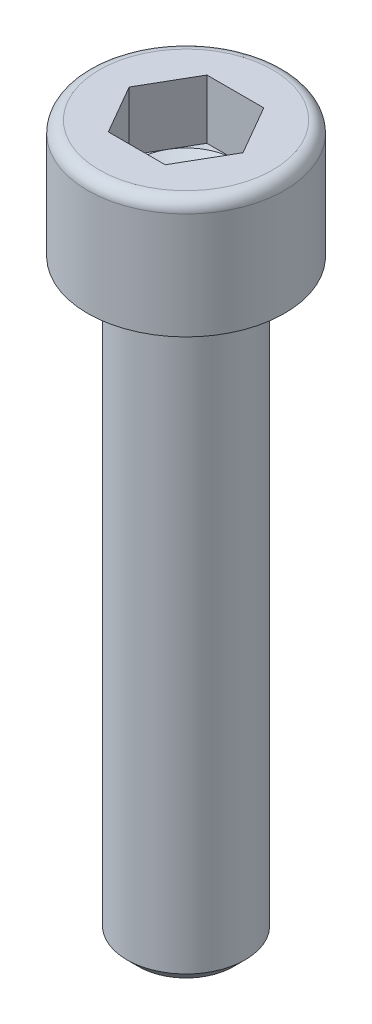
ISO-10303-21;
HEADER;
FILE_DESCRIPTION(('STEP AP214'),'2;1');
FILE_NAME('part.step','',(''),(''),'','','');
FILE_SCHEMA(('AUTOMOTIVE_DESIGN { 1 0 10303 214 1 1 1 1 }'));
ENDSEC;
DATA;
#1=APPLICATION_CONTEXT('core data for automotive mechanical design processes');
#2=APPLICATION_PROTOCOL_DEFINITION('international standard','automotive_design',2000,#1);
#3=PRODUCT_CONTEXT('',#1,'mechanical');
#4=PRODUCT('Part','Part','',(#3));
#5=PRODUCT_RELATED_PRODUCT_CATEGORY('part','',(#4));
#6=PRODUCT_DEFINITION_FORMATION('','',#4);
#7=PRODUCT_DEFINITION_CONTEXT('part definition',#1,'design');
#8=PRODUCT_DEFINITION('design','',#6,#7);
#9=PRODUCT_DEFINITION_SHAPE('','',#8);
#10=(LENGTH_UNIT() NAMED_UNIT(*) SI_UNIT(.MILLI.,.METRE.));
#11=(NAMED_UNIT(*) PLANE_ANGLE_UNIT() SI_UNIT($,.RADIAN.));
#12=(NAMED_UNIT(*) SI_UNIT($,.STERADIAN.) SOLID_ANGLE_UNIT());
#13=UNCERTAINTY_MEASURE_WITH_UNIT(LENGTH_MEASURE(1.E-05),#10,'distance_accuracy_value','');
#14=(GEOMETRIC_REPRESENTATION_CONTEXT(3) GLOBAL_UNCERTAINTY_ASSIGNED_CONTEXT((#13)) GLOBAL_UNIT_ASSIGNED_CONTEXT((#10,
#11,#12)) REPRESENTATION_CONTEXT('',''));
#15=CARTESIAN_POINT('',(0.,0.,0.));
#16=DIRECTION('',(0.,0.,1.));
#17=DIRECTION('',(1.,0.,0.));
#18=AXIS2_PLACEMENT_3D('',#15,#16,#17);
#19=CARTESIAN_POINT('',(0.,-30.,0.));
#20=DIRECTION('',(0.,1.,0.));
#21=DIRECTION('',(0.,0.,1.));
#22=AXIS2_PLACEMENT_3D('',#19,#20,#21);
#23=CYLINDRICAL_SURFACE('',#22,3.);
#24=CARTESIAN_POINT('',(0.,-29.4,0.));
#25=DIRECTION('',(0.,1.,0.));
#26=DIRECTION('',(0.,0.,1.));
#27=AXIS2_PLACEMENT_3D('',#24,#25,#26);
#28=CIRCLE('',#27,3.);
#29=CARTESIAN_POINT('',(0.,-29.4,3.));
#30=VERTEX_POINT('',#29);
#31=EDGE_CURVE('E31',#30,#30,#28,.T.);
#32=ORIENTED_EDGE('',*,*,#31,.T.);
#33=EDGE_LOOP('',(#32));
#34=FACE_BOUND('',#33,.T.);
#35=CARTESIAN_POINT('',(0.,0.,0.));
#36=DIRECTION('',(0.,1.,0.));
#37=DIRECTION('',(0.,0.,1.));
#38=AXIS2_PLACEMENT_3D('',#35,#36,#37);
#39=CIRCLE('',#38,3.);
#40=CARTESIAN_POINT('',(0.,0.,3.));
#41=VERTEX_POINT('',#40);
#42=EDGE_CURVE('E142',#41,#41,#39,.T.);
#43=ORIENTED_EDGE('',*,*,#42,.F.);
#44=EDGE_LOOP('',(#43));
#45=FACE_BOUND('',#44,.T.);
#46=ADVANCED_FACE('F24',(#34,#45),#23,.T.);
#47=CARTESIAN_POINT('',(0.,-30.,0.));
#48=DIRECTION('',(0.,1.,0.));
#49=DIRECTION('',(0.,0.,1.));
#50=AXIS2_PLACEMENT_3D('',#47,#48,#49);
#51=PLANE('',#50);
#52=CARTESIAN_POINT('',(0.,-30.,0.));
#53=DIRECTION('',(0.,1.,0.));
#54=DIRECTION('',(0.,0.,1.));
#55=AXIS2_PLACEMENT_3D('',#52,#53,#54);
#56=CIRCLE('',#55,2.4);
#57=CARTESIAN_POINT('',(0.,-30.,2.4));
#58=VERTEX_POINT('',#57);
#59=EDGE_CURVE('E11',#58,#58,#56,.F.);
#60=ORIENTED_EDGE('',*,*,#59,.T.);
#61=EDGE_LOOP('',(#60));
#62=FACE_BOUND('',#61,.T.);
#63=ADVANCED_FACE('F152',(#62),#51,.F.);
#64=CARTESIAN_POINT('',(0.,-29.4,0.));
#65=DIRECTION('',(0.,1.,0.));
#66=DIRECTION('',(0.,0.,1.));
#67=AXIS2_PLACEMENT_3D('',#64,#65,#66);
#68=CONICAL_SURFACE('',#67,3.,0.785398163397443);
#69=ORIENTED_EDGE('',*,*,#59,.F.);
#70=EDGE_LOOP('',(#69));
#71=FACE_BOUND('',#70,.T.);
#72=ORIENTED_EDGE('',*,*,#31,.F.);
#73=EDGE_LOOP('',(#72));
#74=FACE_BOUND('',#73,.T.);
#75=ADVANCED_FACE('F149',(#71,#74),#68,.T.);
#76=CARTESIAN_POINT('',(0.,0.,0.));
#77=DIRECTION('',(0.,1.,0.));
#78=DIRECTION('',(0.,0.,1.));
#79=AXIS2_PLACEMENT_3D('',#76,#77,#78);
#80=PLANE('',#79);
#81=ORIENTED_EDGE('',*,*,#42,.T.);
#82=EDGE_LOOP('',(#81));
#83=FACE_BOUND('',#82,.T.);
#84=CARTESIAN_POINT('',(0.,0.,0.));
#85=DIRECTION('',(0.,1.,0.));
#86=DIRECTION('',(0.,0.,1.));
#87=AXIS2_PLACEMENT_3D('',#84,#85,#86);
#88=CIRCLE('',#87,5.);
#89=CARTESIAN_POINT('',(0.,0.,5.));
#90=VERTEX_POINT('',#89);
#91=EDGE_CURVE('E139',#90,#90,#88,.T.);
#92=ORIENTED_EDGE('',*,*,#91,.F.);
#93=EDGE_LOOP('',(#92));
#94=FACE_BOUND('',#93,.T.);
#95=ADVANCED_FACE('F151',(#83,#94),#80,.F.);
#96=CARTESIAN_POINT('',(0.,6.,0.));
#97=DIRECTION('',(0.,1.,0.));
#98=DIRECTION('',(0.,0.,1.));
#99=AXIS2_PLACEMENT_3D('',#96,#97,#98);
#100=CYLINDRICAL_SURFACE('',#99,5.);
#101=CARTESIAN_POINT('',(0.,5.4,0.));
#102=DIRECTION('',(0.,1.,0.));
#103=DIRECTION('',(0.,0.,1.));
#104=AXIS2_PLACEMENT_3D('',#101,#102,#103);
#105=CIRCLE('',#104,5.);
#106=CARTESIAN_POINT('',(0.,5.4,5.));
#107=VERTEX_POINT('',#106);
#108=EDGE_CURVE('E136',#107,#107,#105,.T.);
#109=ORIENTED_EDGE('',*,*,#108,.F.);
#110=EDGE_LOOP('',(#109));
#111=FACE_BOUND('',#110,.T.);
#112=ORIENTED_EDGE('',*,*,#91,.T.);
#113=EDGE_LOOP('',(#112));
#114=FACE_BOUND('',#113,.T.);
#115=ADVANCED_FACE('F159',(#111,#114),#100,.T.);
#116=CARTESIAN_POINT('',(0.,5.4,0.));
#117=DIRECTION('',(0.,1.,0.));
#118=DIRECTION('',(0.,0.,1.));
#119=AXIS2_PLACEMENT_3D('',#116,#117,#118);
#120=TOROIDAL_SURFACE('',#119,4.4,0.6);
#121=CARTESIAN_POINT('',(0.,6.,0.));
#122=DIRECTION('',(0.,1.,0.));
#123=DIRECTION('',(0.,0.,1.));
#124=AXIS2_PLACEMENT_3D('',#121,#122,#123);
#125=CIRCLE('',#124,4.4);
#126=CARTESIAN_POINT('',(0.,6.,4.4));
#127=VERTEX_POINT('',#126);
#128=EDGE_CURVE('E131',#127,#127,#125,.T.);
#129=ORIENTED_EDGE('',*,*,#128,.F.);
#130=EDGE_LOOP('',(#129));
#131=FACE_BOUND('',#130,.T.);
#132=ORIENTED_EDGE('',*,*,#108,.T.);
#133=EDGE_LOOP('',(#132));
#134=FACE_BOUND('',#133,.T.);
#135=ADVANCED_FACE('F184',(#131,#134),#120,.T.);
#136=CARTESIAN_POINT('',(2.5,6.,0.));
#137=DIRECTION('',(0.,-1.,0.));
#138=DIRECTION('',(0.,0.,-1.));
#139=AXIS2_PLACEMENT_3D('',#136,#137,#138);
#140=PLANE('',#139);
#141=DIRECTION('',(-1.,0.,0.));
#142=VECTOR('',#141,1.);
#143=CARTESIAN_POINT('',(-1.44337567297407,6.,-2.5));
#144=LINE('',#143,#142);
#145=CARTESIAN_POINT('',(1.44337567297407,6.,-2.5));
#146=VERTEX_POINT('',#145);
#147=CARTESIAN_POINT('',(-1.44337567297407,6.,-2.5));
#148=VERTEX_POINT('',#147);
#149=EDGE_CURVE('E38',#146,#148,#144,.T.);
#150=ORIENTED_EDGE('',*,*,#149,.F.);
#151=DIRECTION('',(-0.499999999999998,0.,-0.86602540378444));
#152=VECTOR('',#151,1.);
#153=CARTESIAN_POINT('',(1.44337567297407,6.,-2.5));
#154=LINE('',#153,#152);
#155=CARTESIAN_POINT('',(2.88675134594812,6.,0.));
#156=VERTEX_POINT('',#155);
#157=EDGE_CURVE('E115',#156,#146,#154,.T.);
#158=ORIENTED_EDGE('',*,*,#157,.F.);
#159=DIRECTION('',(0.499999999999997,0.,-0.86602540378444));
#160=VECTOR('',#159,1.);
#161=CARTESIAN_POINT('',(1.44337567297407,6.,2.5));
#162=LINE('',#161,#160);
#163=CARTESIAN_POINT('',(1.44337567297407,6.,2.5));
#164=VERTEX_POINT('',#163);
#165=EDGE_CURVE('E326',#164,#156,#162,.T.);
#166=ORIENTED_EDGE('',*,*,#165,.F.);
#167=DIRECTION('',(1.,0.,0.));
#168=VECTOR('',#167,1.);
#169=CARTESIAN_POINT('',(-1.44337567297407,6.,2.5));
#170=LINE('',#169,#168);
#171=CARTESIAN_POINT('',(-1.44337567297407,6.,2.5));
#172=VERTEX_POINT('',#171);
#173=EDGE_CURVE('E324',#172,#164,#170,.T.);
#174=ORIENTED_EDGE('',*,*,#173,.F.);
#175=DIRECTION('',(0.499999999999998,0.,0.86602540378444));
#176=VECTOR('',#175,1.);
#177=CARTESIAN_POINT('',(-1.44337567297407,6.,2.5));
#178=LINE('',#177,#176);
#179=CARTESIAN_POINT('',(-2.88675134594812,6.,0.));
#180=VERTEX_POINT('',#179);
#181=EDGE_CURVE('E99',#180,#172,#178,.T.);
#182=ORIENTED_EDGE('',*,*,#181,.F.);
#183=DIRECTION('',(-0.499999999999998,0.,0.86602540378444));
#184=VECTOR('',#183,1.);
#185=CARTESIAN_POINT('',(-1.44337567297407,6.,-2.5));
#186=LINE('',#185,#184);
#187=EDGE_CURVE('E95',#148,#180,#186,.T.);
#188=ORIENTED_EDGE('',*,*,#187,.F.);
#189=EDGE_LOOP('',(#150,#158,#166,#174,#182,#188));
#190=FACE_BOUND('',#189,.T.);
#191=ORIENTED_EDGE('',*,*,#128,.T.);
#192=EDGE_LOOP('',(#191));
#193=FACE_BOUND('',#192,.T.);
#194=ADVANCED_FACE('F96',(#190,#193),#140,.F.);
#195=CARTESIAN_POINT('',(1.44337567297407,3.,-2.5));
#196=DIRECTION('',(0.86602540378444,0.,-0.499999999999998));
#197=DIRECTION('',(-0.499999999999998,0.,-0.86602540378444));
#198=AXIS2_PLACEMENT_3D('',#195,#196,#197);
#199=PLANE('',#198);
#200=ORIENTED_EDGE('',*,*,#157,.T.);
#201=DIRECTION('',(0.,1.,0.));
#202=VECTOR('',#201,1.);
#203=CARTESIAN_POINT('',(1.44337567297407,3.,-2.5));
#204=LINE('',#203,#202);
#205=CARTESIAN_POINT('',(1.44337567297407,3.,-2.5));
#206=VERTEX_POINT('',#205);
#207=EDGE_CURVE('E113',#206,#146,#204,.T.);
#208=ORIENTED_EDGE('',*,*,#207,.F.);
#209=DIRECTION('',(-0.499999999999998,0.,-0.86602540378444));
#210=VECTOR('',#209,1.);
#211=CARTESIAN_POINT('',(1.44337567297407,3.,-2.5));
#212=LINE('',#211,#210);
#213=CARTESIAN_POINT('',(2.1650635094611,3.,-1.24999999999999));
#214=VERTEX_POINT('',#213);
#215=EDGE_CURVE('E328',#214,#206,#212,.T.);
#216=ORIENTED_EDGE('',*,*,#215,.F.);
#217=CARTESIAN_POINT('',(2.88675134594812,3.,0.));
#218=VERTEX_POINT('',#217);
#219=EDGE_CURVE('E332',#218,#214,#212,.T.);
#220=ORIENTED_EDGE('',*,*,#219,.F.);
#221=DIRECTION('',(0.,1.,0.));
#222=VECTOR('',#221,1.);
#223=CARTESIAN_POINT('',(2.88675134594812,3.,0.));
#224=LINE('',#223,#222);
#225=EDGE_CURVE('E316',#218,#156,#224,.T.);
#226=ORIENTED_EDGE('',*,*,#225,.T.);
#227=EDGE_LOOP('',(#200,#208,#216,#220,#226));
#228=FACE_BOUND('',#227,.T.);
#229=ADVANCED_FACE('F199',(#228),#199,.F.);
#230=CARTESIAN_POINT('',(1.44337567297407,3.,2.5));
#231=DIRECTION('',(0.86602540378444,0.,0.499999999999997));
#232=DIRECTION('',(0.499999999999998,0.,-0.86602540378444));
#233=AXIS2_PLACEMENT_3D('',#230,#231,#232);
#234=PLANE('',#233);
#235=ORIENTED_EDGE('',*,*,#165,.T.);
#236=ORIENTED_EDGE('',*,*,#225,.F.);
#237=DIRECTION('',(0.499999999999997,0.,-0.86602540378444));
#238=VECTOR('',#237,1.);
#239=CARTESIAN_POINT('',(1.44337567297407,3.,2.5));
#240=LINE('',#239,#238);
#241=CARTESIAN_POINT('',(2.1650635094611,3.,1.24999999999999));
#242=VERTEX_POINT('',#241);
#243=EDGE_CURVE('E312',#242,#218,#240,.T.);
#244=ORIENTED_EDGE('',*,*,#243,.F.);
#245=CARTESIAN_POINT('',(1.44337567297407,3.,2.5));
#246=VERTEX_POINT('',#245);
#247=EDGE_CURVE('E46',#246,#242,#240,.T.);
#248=ORIENTED_EDGE('',*,*,#247,.F.);
#249=DIRECTION('',(0.,1.,0.));
#250=VECTOR('',#249,1.);
#251=CARTESIAN_POINT('',(1.44337567297407,3.,2.5));
#252=LINE('',#251,#250);
#253=EDGE_CURVE('E306',#246,#164,#252,.T.);
#254=ORIENTED_EDGE('',*,*,#253,.T.);
#255=EDGE_LOOP('',(#235,#236,#244,#248,#254));
#256=FACE_BOUND('',#255,.T.);
#257=ADVANCED_FACE('F216',(#256),#234,.F.);
#258=CARTESIAN_POINT('',(-1.44337567297407,3.,2.5));
#259=DIRECTION('',(0.,0.,1.));
#260=DIRECTION('',(1.,0.,0.));
#261=AXIS2_PLACEMENT_3D('',#258,#259,#260);
#262=PLANE('',#261);
#263=ORIENTED_EDGE('',*,*,#173,.T.);
#264=ORIENTED_EDGE('',*,*,#253,.F.);
#265=DIRECTION('',(1.,0.,0.));
#266=VECTOR('',#265,1.);
#267=CARTESIAN_POINT('',(-1.44337567297407,3.,2.5));
#268=LINE('',#267,#266);
#269=CARTESIAN_POINT('',(0.,3.,2.5));
#270=VERTEX_POINT('',#269);
#271=EDGE_CURVE('E295',#270,#246,#268,.T.);
#272=ORIENTED_EDGE('',*,*,#271,.F.);
#273=CARTESIAN_POINT('',(-1.44337567297407,3.,2.5));
#274=VERTEX_POINT('',#273);
#275=EDGE_CURVE('E304',#274,#270,#268,.T.);
#276=ORIENTED_EDGE('',*,*,#275,.F.);
#277=DIRECTION('',(0.,1.,0.));
#278=VECTOR('',#277,1.);
#279=CARTESIAN_POINT('',(-1.44337567297407,3.,2.5));
#280=LINE('',#279,#278);
#281=EDGE_CURVE('E123',#274,#172,#280,.T.);
#282=ORIENTED_EDGE('',*,*,#281,.T.);
#283=EDGE_LOOP('',(#263,#264,#272,#276,#282));
#284=FACE_BOUND('',#283,.T.);
#285=ADVANCED_FACE('F224',(#284),#262,.F.);
#286=CARTESIAN_POINT('',(-1.44337567297407,3.,2.5));
#287=DIRECTION('',(-0.86602540378444,0.,0.499999999999998));
#288=DIRECTION('',(0.499999999999998,0.,0.86602540378444));
#289=AXIS2_PLACEMENT_3D('',#286,#287,#288);
#290=PLANE('',#289);
#291=ORIENTED_EDGE('',*,*,#181,.T.);
#292=ORIENTED_EDGE('',*,*,#281,.F.);
#293=DIRECTION('',(0.499999999999998,0.,0.86602540378444));
#294=VECTOR('',#293,1.);
#295=CARTESIAN_POINT('',(-1.44337567297407,3.,2.5));
#296=LINE('',#295,#294);
#297=CARTESIAN_POINT('',(-2.1650635094611,3.,1.24999999999999));
#298=VERTEX_POINT('',#297);
#299=EDGE_CURVE('E310',#298,#274,#296,.T.);
#300=ORIENTED_EDGE('',*,*,#299,.F.);
#301=CARTESIAN_POINT('',(-2.88675134594812,3.,0.));
#302=VERTEX_POINT('',#301);
#303=EDGE_CURVE('E307',#302,#298,#296,.T.);
#304=ORIENTED_EDGE('',*,*,#303,.F.);
#305=DIRECTION('',(0.,1.,0.));
#306=VECTOR('',#305,1.);
#307=CARTESIAN_POINT('',(-2.88675134594812,3.,0.));
#308=LINE('',#307,#306);
#309=EDGE_CURVE('E121',#302,#180,#308,.T.);
#310=ORIENTED_EDGE('',*,*,#309,.T.);
#311=EDGE_LOOP('',(#291,#292,#300,#304,#310));
#312=FACE_BOUND('',#311,.T.);
#313=ADVANCED_FACE('F232',(#312),#290,.F.);
#314=CARTESIAN_POINT('',(-1.44337567297407,3.,-2.5));
#315=DIRECTION('',(-0.86602540378444,0.,-0.499999999999998));
#316=DIRECTION('',(-0.499999999999998,0.,0.86602540378444));
#317=AXIS2_PLACEMENT_3D('',#314,#315,#316);
#318=PLANE('',#317);
#319=ORIENTED_EDGE('',*,*,#187,.T.);
#320=ORIENTED_EDGE('',*,*,#309,.F.);
#321=DIRECTION('',(-0.499999999999998,0.,0.86602540378444));
#322=VECTOR('',#321,1.);
#323=CARTESIAN_POINT('',(-1.44337567297407,3.,-2.5));
#324=LINE('',#323,#322);
#325=CARTESIAN_POINT('',(-2.1650635094611,3.,-1.24999999999999));
#326=VERTEX_POINT('',#325);
#327=EDGE_CURVE('E339',#326,#302,#324,.T.);
#328=ORIENTED_EDGE('',*,*,#327,.F.);
#329=CARTESIAN_POINT('',(-1.44337567297407,3.,-2.5));
#330=VERTEX_POINT('',#329);
#331=EDGE_CURVE('E120',#330,#326,#324,.T.);
#332=ORIENTED_EDGE('',*,*,#331,.F.);
#333=DIRECTION('',(0.,1.,0.));
#334=VECTOR('',#333,1.);
#335=CARTESIAN_POINT('',(-1.44337567297407,3.,-2.5));
#336=LINE('',#335,#334);
#337=EDGE_CURVE('E109',#330,#148,#336,.T.);
#338=ORIENTED_EDGE('',*,*,#337,.T.);
#339=EDGE_LOOP('',(#319,#320,#328,#332,#338));
#340=FACE_BOUND('',#339,.T.);
#341=ADVANCED_FACE('F117',(#340),#318,.F.);
#342=CARTESIAN_POINT('',(-1.44337567297407,3.,-2.5));
#343=DIRECTION('',(0.,0.,-1.));
#344=DIRECTION('',(-1.,0.,0.));
#345=AXIS2_PLACEMENT_3D('',#342,#343,#344);
#346=PLANE('',#345);
#347=ORIENTED_EDGE('',*,*,#149,.T.);
#348=ORIENTED_EDGE('',*,*,#337,.F.);
#349=DIRECTION('',(-1.,0.,0.));
#350=VECTOR('',#349,1.);
#351=CARTESIAN_POINT('',(-1.44337567297407,3.,-2.5));
#352=LINE('',#351,#350);
#353=CARTESIAN_POINT('',(0.,3.,-2.5));
#354=VERTEX_POINT('',#353);
#355=EDGE_CURVE('E335',#354,#330,#352,.T.);
#356=ORIENTED_EDGE('',*,*,#355,.F.);
#357=EDGE_CURVE('E336',#206,#354,#352,.T.);
#358=ORIENTED_EDGE('',*,*,#357,.F.);
#359=ORIENTED_EDGE('',*,*,#207,.T.);
#360=EDGE_LOOP('',(#347,#348,#356,#358,#359));
#361=FACE_BOUND('',#360,.T.);
#362=ADVANCED_FACE('F107',(#361),#346,.F.);
#363=CARTESIAN_POINT('',(4.33012701892218,3.,2.5));
#364=DIRECTION('',(0.,1.,0.));
#365=DIRECTION('',(0.,0.,1.));
#366=AXIS2_PLACEMENT_3D('',#363,#364,#365);
#367=PLANE('',#366);
#368=CARTESIAN_POINT('',(0.,3.,0.));
#369=DIRECTION('',(0.,1.,0.));
#370=DIRECTION('',(0.,0.,1.));
#371=AXIS2_PLACEMENT_3D('',#368,#369,#370);
#372=CIRCLE('',#371,2.5);
#373=EDGE_CURVE('E133',#298,#270,#372,.T.);
#374=ORIENTED_EDGE('',*,*,#373,.F.);
#375=ORIENTED_EDGE('',*,*,#299,.T.);
#376=ORIENTED_EDGE('',*,*,#275,.T.);
#377=EDGE_LOOP('',(#374,#375,#376));
#378=FACE_BOUND('',#377,.T.);
#379=ADVANCED_FACE('F253',(#378),#367,.T.);
#380=EDGE_CURVE('E315',#326,#298,#372,.T.);
#381=ORIENTED_EDGE('',*,*,#380,.F.);
#382=ORIENTED_EDGE('',*,*,#327,.T.);
#383=ORIENTED_EDGE('',*,*,#303,.T.);
#384=EDGE_LOOP('',(#381,#382,#383));
#385=FACE_BOUND('',#384,.T.);
#386=ADVANCED_FACE('F260',(#385),#367,.T.);
#387=EDGE_CURVE('E317',#354,#326,#372,.T.);
#388=ORIENTED_EDGE('',*,*,#387,.F.);
#389=ORIENTED_EDGE('',*,*,#355,.T.);
#390=ORIENTED_EDGE('',*,*,#331,.T.);
#391=EDGE_LOOP('',(#388,#389,#390));
#392=FACE_BOUND('',#391,.T.);
#393=ADVANCED_FACE('F268',(#392),#367,.T.);
#394=EDGE_CURVE('E344',#214,#354,#372,.T.);
#395=ORIENTED_EDGE('',*,*,#394,.F.);
#396=ORIENTED_EDGE('',*,*,#215,.T.);
#397=ORIENTED_EDGE('',*,*,#357,.T.);
#398=EDGE_LOOP('',(#395,#396,#397));
#399=FACE_BOUND('',#398,.T.);
#400=ADVANCED_FACE('F275',(#399),#367,.T.);
#401=EDGE_CURVE('E132',#242,#214,#372,.T.);
#402=ORIENTED_EDGE('',*,*,#401,.F.);
#403=ORIENTED_EDGE('',*,*,#243,.T.);
#404=ORIENTED_EDGE('',*,*,#219,.T.);
#405=EDGE_LOOP('',(#402,#403,#404));
#406=FACE_BOUND('',#405,.T.);
#407=ADVANCED_FACE('F282',(#406),#367,.T.);
#408=EDGE_CURVE('E128',#270,#242,#372,.T.);
#409=ORIENTED_EDGE('',*,*,#408,.F.);
#410=ORIENTED_EDGE('',*,*,#271,.T.);
#411=ORIENTED_EDGE('',*,*,#247,.T.);
#412=EDGE_LOOP('',(#409,#410,#411));
#413=FACE_BOUND('',#412,.T.);
#414=ADVANCED_FACE('F208',(#413),#367,.T.);
#415=CARTESIAN_POINT('',(0.,3.,0.));
#416=DIRECTION('',(0.,1.,0.));
#417=DIRECTION('',(0.,0.,1.));
#418=AXIS2_PLACEMENT_3D('',#415,#416,#417);
#419=CONICAL_SURFACE('',#418,2.5,1.04719755119659);
#420=CARTESIAN_POINT('',(0.,1.55662432702592,0.));
#421=VERTEX_POINT('',#420);
#422=VERTEX_LOOP('',#421);
#423=FACE_BOUND('',#422,.T.);
#424=ORIENTED_EDGE('',*,*,#408,.T.);
#425=ORIENTED_EDGE('',*,*,#401,.T.);
#426=ORIENTED_EDGE('',*,*,#394,.T.);
#427=ORIENTED_EDGE('',*,*,#387,.T.);
#428=ORIENTED_EDGE('',*,*,#380,.T.);
#429=ORIENTED_EDGE('',*,*,#373,.T.);
#430=EDGE_LOOP('',(#424,#425,#426,#427,#428,#429));
#431=FACE_BOUND('',#430,.T.);
#432=ADVANCED_FACE('F203',(#423,#431),#419,.F.);
#433=CLOSED_SHELL('',(#46,#63,#75,#95,#115,#135,#194,#229,#257,#285,#313,#341,#362,#379,#386,
#393,#400,#407,#414,#432));
#434=MANIFOLD_SOLID_BREP('B2',#433);
#435=ADVANCED_BREP_SHAPE_REPRESENTATION('',(#18,#434),#14);
#436=SHAPE_DEFINITION_REPRESENTATION(#9,#435);
ENDSEC;
END-ISO-10303-21;
